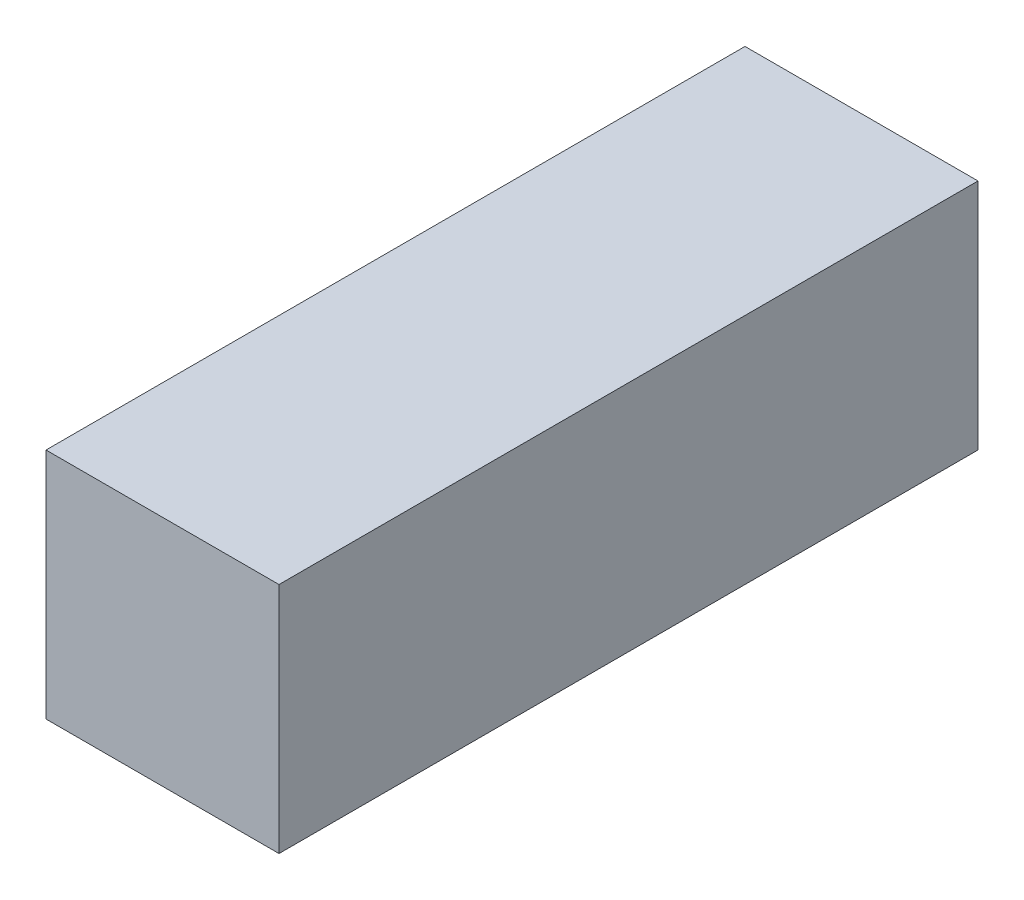
ISO-10303-21;
HEADER;
FILE_DESCRIPTION(('STEP AP214'),'2;1');
FILE_NAME('part.step','',(''),(''),'','','');
FILE_SCHEMA(('AUTOMOTIVE_DESIGN { 1 0 10303 214 1 1 1 1 }'));
ENDSEC;
DATA;
#1=APPLICATION_CONTEXT('core data for automotive mechanical design processes');
#2=APPLICATION_PROTOCOL_DEFINITION('international standard','automotive_design',2000,#1);
#3=PRODUCT_CONTEXT('',#1,'mechanical');
#4=PRODUCT('Part','Part','',(#3));
#5=PRODUCT_RELATED_PRODUCT_CATEGORY('part','',(#4));
#6=PRODUCT_DEFINITION_FORMATION('','',#4);
#7=PRODUCT_DEFINITION_CONTEXT('part definition',#1,'design');
#8=PRODUCT_DEFINITION('design','',#6,#7);
#9=PRODUCT_DEFINITION_SHAPE('','',#8);
#10=(LENGTH_UNIT() NAMED_UNIT(*) SI_UNIT(.MILLI.,.METRE.));
#11=(NAMED_UNIT(*) PLANE_ANGLE_UNIT() SI_UNIT($,.RADIAN.));
#12=(NAMED_UNIT(*) SI_UNIT($,.STERADIAN.) SOLID_ANGLE_UNIT());
#13=UNCERTAINTY_MEASURE_WITH_UNIT(LENGTH_MEASURE(1.E-05),#10,'distance_accuracy_value','');
#14=(GEOMETRIC_REPRESENTATION_CONTEXT(3) GLOBAL_UNCERTAINTY_ASSIGNED_CONTEXT((#13)) GLOBAL_UNIT_ASSIGNED_CONTEXT((#10,
#11,#12)) REPRESENTATION_CONTEXT('',''));
#15=CARTESIAN_POINT('',(0.,0.,0.));
#16=DIRECTION('',(0.,0.,1.));
#17=DIRECTION('',(1.,0.,0.));
#18=AXIS2_PLACEMENT_3D('',#15,#16,#17);
#19=CARTESIAN_POINT('',(3.175,-3.175,19.05));
#20=DIRECTION('',(-1.,0.,0.));
#21=DIRECTION('',(0.,0.,1.));
#22=AXIS2_PLACEMENT_3D('',#19,#20,#21);
#23=PLANE('',#22);
#24=DIRECTION('',(0.,1.,0.));
#25=VECTOR('',#24,1.);
#26=CARTESIAN_POINT('',(3.175,-3.175,0.));
#27=LINE('',#26,#25);
#28=CARTESIAN_POINT('',(3.175,-3.175,0.));
#29=VERTEX_POINT('',#28);
#30=CARTESIAN_POINT('',(3.175,3.175,0.));
#31=VERTEX_POINT('',#30);
#32=EDGE_CURVE('E98',#29,#31,#27,.T.);
#33=ORIENTED_EDGE('',*,*,#32,.T.);
#34=DIRECTION('',(0.,0.,-1.));
#35=VECTOR('',#34,1.);
#36=CARTESIAN_POINT('',(3.175,3.175,19.05));
#37=LINE('',#36,#35);
#38=CARTESIAN_POINT('',(3.175,3.175,19.05));
#39=VERTEX_POINT('',#38);
#40=EDGE_CURVE('E11',#39,#31,#37,.T.);
#41=ORIENTED_EDGE('',*,*,#40,.F.);
#42=DIRECTION('',(0.,1.,0.));
#43=VECTOR('',#42,1.);
#44=CARTESIAN_POINT('',(3.175,-3.175,19.05));
#45=LINE('',#44,#43);
#46=CARTESIAN_POINT('',(3.175,-3.175,19.05));
#47=VERTEX_POINT('',#46);
#48=EDGE_CURVE('E86',#47,#39,#45,.T.);
#49=ORIENTED_EDGE('',*,*,#48,.F.);
#50=DIRECTION('',(0.,0.,-1.));
#51=VECTOR('',#50,1.);
#52=CARTESIAN_POINT('',(3.175,-3.175,19.05));
#53=LINE('',#52,#51);
#54=EDGE_CURVE('E94',#47,#29,#53,.T.);
#55=ORIENTED_EDGE('',*,*,#54,.T.);
#56=EDGE_LOOP('',(#33,#41,#49,#55));
#57=FACE_BOUND('',#56,.T.);
#58=ADVANCED_FACE('F35',(#57),#23,.F.);
#59=CARTESIAN_POINT('',(-3.175,3.175,19.05));
#60=DIRECTION('',(0.,-1.,0.));
#61=DIRECTION('',(0.,0.,-1.));
#62=AXIS2_PLACEMENT_3D('',#59,#60,#61);
#63=PLANE('',#62);
#64=DIRECTION('',(-1.,0.,0.));
#65=VECTOR('',#64,1.);
#66=CARTESIAN_POINT('',(-3.175,3.175,0.));
#67=LINE('',#66,#65);
#68=CARTESIAN_POINT('',(-3.175,3.175,0.));
#69=VERTEX_POINT('',#68);
#70=EDGE_CURVE('E90',#31,#69,#67,.T.);
#71=ORIENTED_EDGE('',*,*,#70,.T.);
#72=DIRECTION('',(0.,0.,-1.));
#73=VECTOR('',#72,1.);
#74=CARTESIAN_POINT('',(-3.175,3.175,19.05));
#75=LINE('',#74,#73);
#76=CARTESIAN_POINT('',(-3.175,3.175,19.05));
#77=VERTEX_POINT('',#76);
#78=EDGE_CURVE('E43',#77,#69,#75,.T.);
#79=ORIENTED_EDGE('',*,*,#78,.F.);
#80=DIRECTION('',(-1.,0.,0.));
#81=VECTOR('',#80,1.);
#82=CARTESIAN_POINT('',(-3.175,3.175,19.05));
#83=LINE('',#82,#81);
#84=EDGE_CURVE('E81',#39,#77,#83,.T.);
#85=ORIENTED_EDGE('',*,*,#84,.F.);
#86=ORIENTED_EDGE('',*,*,#40,.T.);
#87=EDGE_LOOP('',(#71,#79,#85,#86));
#88=FACE_BOUND('',#87,.T.);
#89=ADVANCED_FACE('F89',(#88),#63,.F.);
#90=CARTESIAN_POINT('',(-3.175,-3.175,19.05));
#91=DIRECTION('',(1.,0.,0.));
#92=DIRECTION('',(0.,0.,-1.));
#93=AXIS2_PLACEMENT_3D('',#90,#91,#92);
#94=PLANE('',#93);
#95=DIRECTION('',(0.,-1.,0.));
#96=VECTOR('',#95,1.);
#97=CARTESIAN_POINT('',(-3.175,-3.175,0.));
#98=LINE('',#97,#96);
#99=CARTESIAN_POINT('',(-3.175,-3.175,0.));
#100=VERTEX_POINT('',#99);
#101=EDGE_CURVE('E68',#69,#100,#98,.T.);
#102=ORIENTED_EDGE('',*,*,#101,.T.);
#103=DIRECTION('',(0.,0.,-1.));
#104=VECTOR('',#103,1.);
#105=CARTESIAN_POINT('',(-3.175,-3.175,19.05));
#106=LINE('',#105,#104);
#107=CARTESIAN_POINT('',(-3.175,-3.175,19.05));
#108=VERTEX_POINT('',#107);
#109=EDGE_CURVE('E91',#108,#100,#106,.T.);
#110=ORIENTED_EDGE('',*,*,#109,.F.);
#111=DIRECTION('',(0.,-1.,0.));
#112=VECTOR('',#111,1.);
#113=CARTESIAN_POINT('',(-3.175,-3.175,19.05));
#114=LINE('',#113,#112);
#115=EDGE_CURVE('E84',#77,#108,#114,.T.);
#116=ORIENTED_EDGE('',*,*,#115,.F.);
#117=ORIENTED_EDGE('',*,*,#78,.T.);
#118=EDGE_LOOP('',(#102,#110,#116,#117));
#119=FACE_BOUND('',#118,.T.);
#120=ADVANCED_FACE('F92',(#119),#94,.F.);
#121=CARTESIAN_POINT('',(-3.175,-3.175,19.05));
#122=DIRECTION('',(0.,1.,0.));
#123=DIRECTION('',(0.,0.,1.));
#124=AXIS2_PLACEMENT_3D('',#121,#122,#123);
#125=PLANE('',#124);
#126=DIRECTION('',(1.,0.,0.));
#127=VECTOR('',#126,1.);
#128=CARTESIAN_POINT('',(-3.175,-3.175,0.));
#129=LINE('',#128,#127);
#130=EDGE_CURVE('E74',#100,#29,#129,.T.);
#131=ORIENTED_EDGE('',*,*,#130,.T.);
#132=ORIENTED_EDGE('',*,*,#54,.F.);
#133=DIRECTION('',(1.,0.,0.));
#134=VECTOR('',#133,1.);
#135=CARTESIAN_POINT('',(-3.175,-3.175,19.05));
#136=LINE('',#135,#134);
#137=EDGE_CURVE('E51',#108,#47,#136,.T.);
#138=ORIENTED_EDGE('',*,*,#137,.F.);
#139=ORIENTED_EDGE('',*,*,#109,.T.);
#140=EDGE_LOOP('',(#131,#132,#138,#139));
#141=FACE_BOUND('',#140,.T.);
#142=ADVANCED_FACE('F105',(#141),#125,.F.);
#143=CARTESIAN_POINT('',(0.,0.,19.05));
#144=DIRECTION('',(0.,0.,-1.));
#145=DIRECTION('',(-1.,0.,0.));
#146=AXIS2_PLACEMENT_3D('',#143,#144,#145);
#147=PLANE('',#146);
#148=ORIENTED_EDGE('',*,*,#48,.T.);
#149=ORIENTED_EDGE('',*,*,#84,.T.);
#150=ORIENTED_EDGE('',*,*,#115,.T.);
#151=ORIENTED_EDGE('',*,*,#137,.T.);
#152=EDGE_LOOP('',(#148,#149,#150,#151));
#153=FACE_BOUND('',#152,.T.);
#154=ADVANCED_FACE('F82',(#153),#147,.F.);
#155=CARTESIAN_POINT('',(0.,0.,0.));
#156=DIRECTION('',(0.,0.,-1.));
#157=DIRECTION('',(-1.,0.,0.));
#158=AXIS2_PLACEMENT_3D('',#155,#156,#157);
#159=PLANE('',#158);
#160=ORIENTED_EDGE('',*,*,#32,.F.);
#161=ORIENTED_EDGE('',*,*,#130,.F.);
#162=ORIENTED_EDGE('',*,*,#101,.F.);
#163=ORIENTED_EDGE('',*,*,#70,.F.);
#164=EDGE_LOOP('',(#160,#161,#162,#163));
#165=FACE_BOUND('',#164,.T.);
#166=ADVANCED_FACE('F108',(#165),#159,.T.);
#167=CLOSED_SHELL('',(#58,#89,#120,#142,#154,#166));
#168=MANIFOLD_SOLID_BREP('B2',#167);
#169=ADVANCED_BREP_SHAPE_REPRESENTATION('',(#18,#168),#14);
#170=SHAPE_DEFINITION_REPRESENTATION(#9,#169);
ENDSEC;
END-ISO-10303-21;
